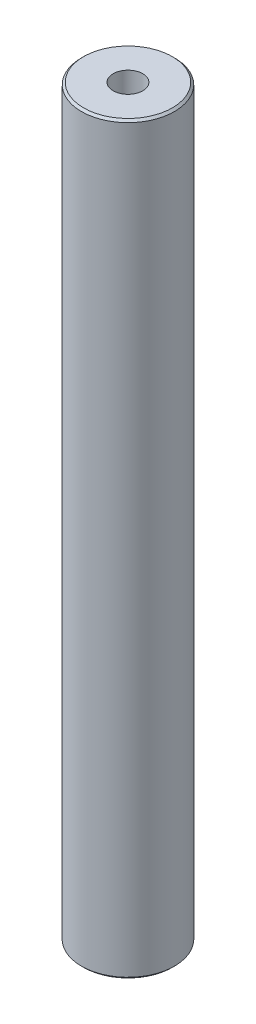
ISO-10303-21;
HEADER;
FILE_DESCRIPTION(('STEP AP214'),'2;1');
FILE_NAME('part.step','',(''),(''),'','','');
FILE_SCHEMA(('AUTOMOTIVE_DESIGN { 1 0 10303 214 1 1 1 1 }'));
ENDSEC;
DATA;
#1=APPLICATION_CONTEXT('core data for automotive mechanical design processes');
#2=APPLICATION_PROTOCOL_DEFINITION('international standard','automotive_design',2000,#1);
#3=PRODUCT_CONTEXT('',#1,'mechanical');
#4=PRODUCT('Part','Part','',(#3));
#5=PRODUCT_RELATED_PRODUCT_CATEGORY('part','',(#4));
#6=PRODUCT_DEFINITION_FORMATION('','',#4);
#7=PRODUCT_DEFINITION_CONTEXT('part definition',#1,'design');
#8=PRODUCT_DEFINITION('design','',#6,#7);
#9=PRODUCT_DEFINITION_SHAPE('','',#8);
#10=(LENGTH_UNIT() NAMED_UNIT(*) SI_UNIT(.MILLI.,.METRE.));
#11=(NAMED_UNIT(*) PLANE_ANGLE_UNIT() SI_UNIT($,.RADIAN.));
#12=(NAMED_UNIT(*) SI_UNIT($,.STERADIAN.) SOLID_ANGLE_UNIT());
#13=UNCERTAINTY_MEASURE_WITH_UNIT(LENGTH_MEASURE(1.E-05),#10,'distance_accuracy_value','');
#14=(GEOMETRIC_REPRESENTATION_CONTEXT(3) GLOBAL_UNCERTAINTY_ASSIGNED_CONTEXT((#13)) GLOBAL_UNIT_ASSIGNED_CONTEXT((#10,
#11,#12)) REPRESENTATION_CONTEXT('',''));
#15=CARTESIAN_POINT('',(0.,0.,0.));
#16=DIRECTION('',(0.,0.,1.));
#17=DIRECTION('',(1.,0.,0.));
#18=AXIS2_PLACEMENT_3D('',#15,#16,#17);
#19=CARTESIAN_POINT('',(0.,600.,0.));
#20=DIRECTION('',(0.,-1.,0.));
#21=DIRECTION('',(0.,0.,-1.));
#22=AXIS2_PLACEMENT_3D('',#19,#20,#21);
#23=CYLINDRICAL_SURFACE('',#22,37.5);
#24=CARTESIAN_POINT('',(0.,598.282689533271,0.));
#25=DIRECTION('',(0.,1.,0.));
#26=DIRECTION('',(0.,0.,1.));
#27=AXIS2_PLACEMENT_3D('',#24,#25,#26);
#28=CIRCLE('',#27,37.5);
#29=CARTESIAN_POINT('',(0.,598.282689533271,37.5));
#30=VERTEX_POINT('',#29);
#31=EDGE_CURVE('E50',#30,#30,#28,.F.);
#32=ORIENTED_EDGE('',*,*,#31,.T.);
#33=EDGE_LOOP('',(#32));
#34=FACE_BOUND('',#33,.T.);
#35=CARTESIAN_POINT('',(0.,1.71731046672852,0.));
#36=DIRECTION('',(0.,1.,0.));
#37=DIRECTION('',(0.,0.,1.));
#38=AXIS2_PLACEMENT_3D('',#35,#36,#37);
#39=CIRCLE('',#38,37.5);
#40=CARTESIAN_POINT('',(0.,1.71731046672852,37.5));
#41=VERTEX_POINT('',#40);
#42=EDGE_CURVE('E51',#41,#41,#39,.T.);
#43=ORIENTED_EDGE('',*,*,#42,.T.);
#44=EDGE_LOOP('',(#43));
#45=FACE_BOUND('',#44,.T.);
#46=ADVANCED_FACE('F39',(#34,#45),#23,.T.);
#47=CARTESIAN_POINT('',(0.,600.,0.));
#48=DIRECTION('',(0.,1.,0.));
#49=DIRECTION('',(0.,0.,1.));
#50=AXIS2_PLACEMENT_3D('',#47,#48,#49);
#51=PLANE('',#50);
#52=CARTESIAN_POINT('',(0.,600.,0.));
#53=DIRECTION('',(0.,1.,0.));
#54=DIRECTION('',(0.,0.,1.));
#55=AXIS2_PLACEMENT_3D('',#52,#53,#54);
#56=CIRCLE('',#55,35.7826895332714);
#57=CARTESIAN_POINT('',(0.,600.,35.7826895332714));
#58=VERTEX_POINT('',#57);
#59=EDGE_CURVE('E54',#58,#58,#56,.T.);
#60=ORIENTED_EDGE('',*,*,#59,.T.);
#61=EDGE_LOOP('',(#60));
#62=FACE_BOUND('',#61,.T.);
#63=CARTESIAN_POINT('',(0.,600.,0.));
#64=DIRECTION('',(0.,1.,0.));
#65=DIRECTION('',(0.,0.,1.));
#66=AXIS2_PLACEMENT_3D('',#63,#64,#65);
#67=CIRCLE('',#66,11.9451094618148);
#68=CARTESIAN_POINT('',(0.,600.,11.9451094618148));
#69=VERTEX_POINT('',#68);
#70=EDGE_CURVE('E58',#69,#69,#67,.T.);
#71=ORIENTED_EDGE('',*,*,#70,.F.);
#72=EDGE_LOOP('',(#71));
#73=FACE_BOUND('',#72,.T.);
#74=ADVANCED_FACE('F69',(#62,#73),#51,.T.);
#75=CARTESIAN_POINT('',(0.,0.,0.));
#76=DIRECTION('',(0.,1.,0.));
#77=DIRECTION('',(0.,0.,1.));
#78=AXIS2_PLACEMENT_3D('',#75,#76,#77);
#79=PLANE('',#78);
#80=CARTESIAN_POINT('',(0.,0.,0.));
#81=DIRECTION('',(0.,1.,0.));
#82=DIRECTION('',(0.,0.,1.));
#83=AXIS2_PLACEMENT_3D('',#80,#81,#82);
#84=CIRCLE('',#83,35.7826895332715);
#85=CARTESIAN_POINT('',(0.,0.,35.7826895332715));
#86=VERTEX_POINT('',#85);
#87=EDGE_CURVE('E10',#86,#86,#84,.F.);
#88=ORIENTED_EDGE('',*,*,#87,.T.);
#89=EDGE_LOOP('',(#88));
#90=FACE_BOUND('',#89,.T.);
#91=CARTESIAN_POINT('',(0.,0.,0.));
#92=DIRECTION('',(0.,1.,0.));
#93=DIRECTION('',(0.,0.,1.));
#94=AXIS2_PLACEMENT_3D('',#91,#92,#93);
#95=CIRCLE('',#94,11.9451094618148);
#96=CARTESIAN_POINT('',(0.,0.,11.9451094618148));
#97=VERTEX_POINT('',#96);
#98=EDGE_CURVE('E63',#97,#97,#95,.T.);
#99=ORIENTED_EDGE('',*,*,#98,.T.);
#100=EDGE_LOOP('',(#99));
#101=FACE_BOUND('',#100,.T.);
#102=ADVANCED_FACE('F75',(#90,#101),#79,.F.);
#103=CARTESIAN_POINT('',(0.,600.,0.));
#104=DIRECTION('',(0.,-1.,0.));
#105=DIRECTION('',(0.,0.,-1.));
#106=AXIS2_PLACEMENT_3D('',#103,#104,#105);
#107=CYLINDRICAL_SURFACE('',#106,11.9451094618148);
#108=ORIENTED_EDGE('',*,*,#70,.T.);
#109=EDGE_LOOP('',(#108));
#110=FACE_BOUND('',#109,.T.);
#111=ORIENTED_EDGE('',*,*,#98,.F.);
#112=EDGE_LOOP('',(#111));
#113=FACE_BOUND('',#112,.T.);
#114=ADVANCED_FACE('F70',(#110,#113),#107,.F.);
#115=CARTESIAN_POINT('',(0.,600.,0.));
#116=DIRECTION('',(0.,-1.,0.));
#117=DIRECTION('',(0.,0.,-1.));
#118=AXIS2_PLACEMENT_3D('',#115,#116,#117);
#119=CONICAL_SURFACE('',#118,35.7826895332714,0.785398163397408);
#120=ORIENTED_EDGE('',*,*,#31,.F.);
#121=EDGE_LOOP('',(#120));
#122=FACE_BOUND('',#121,.T.);
#123=ORIENTED_EDGE('',*,*,#59,.F.);
#124=EDGE_LOOP('',(#123));
#125=FACE_BOUND('',#124,.T.);
#126=ADVANCED_FACE('F81',(#122,#125),#119,.T.);
#127=CARTESIAN_POINT('',(0.,1.71731046672852,0.));
#128=DIRECTION('',(0.,1.,0.));
#129=DIRECTION('',(0.,0.,1.));
#130=AXIS2_PLACEMENT_3D('',#127,#128,#129);
#131=CONICAL_SURFACE('',#130,37.5,0.785398163397456);
#132=CARTESIAN_POINT('',(0.,0.,35.7826895332715));
#133=CARTESIAN_POINT('',(0.,0.0178886506950884,35.8005781839666));
#134=CARTESIAN_POINT('',(0.,0.0357773013901772,35.8184668346616));
#135=CARTESIAN_POINT('',(0.,0.0715546027803547,35.8542441360518));
#136=CARTESIAN_POINT('',(0.,0.0894432534754434,35.8721327867469));
#137=CARTESIAN_POINT('',(0.,0.125220554865621,35.9079100881371));
#138=CARTESIAN_POINT('',(0.,0.143109205560709,35.9257987388322));
#139=CARTESIAN_POINT('',(0.,0.178886506950887,35.9615760402223));
#140=CARTESIAN_POINT('',(0.,0.196775157645976,35.9794646909174));
#141=CARTESIAN_POINT('',(0.,0.232552459036154,36.0152419923076));
#142=CARTESIAN_POINT('',(0.,0.250441109731241,36.0331306430027));
#143=CARTESIAN_POINT('',(0.,0.286218411121418,36.0689079443929));
#144=CARTESIAN_POINT('',(0.,0.304107061816508,36.086796595088));
#145=CARTESIAN_POINT('',(0.,0.339884363206686,36.1225738964782));
#146=CARTESIAN_POINT('',(0.,0.357773013901774,36.1404625471732));
#147=CARTESIAN_POINT('',(0.,0.393550315291951,36.1762398485634));
#148=CARTESIAN_POINT('',(0.,0.41143896598704,36.1941284992585));
#149=CARTESIAN_POINT('',(0.,0.447216267377218,36.2299058006487));
#150=CARTESIAN_POINT('',(0.,0.465104918072306,36.2477944513438));
#151=CARTESIAN_POINT('',(0.,0.500882219462484,36.283571752734));
#152=CARTESIAN_POINT('',(0.,0.518770870157573,36.301460403429));
#153=CARTESIAN_POINT('',(0.,0.55454817154775,36.3372377048192));
#154=CARTESIAN_POINT('',(0.,0.572436822242838,36.3551263555143));
#155=CARTESIAN_POINT('',(0.,0.608214123633016,36.3909036569045));
#156=CARTESIAN_POINT('',(0.,0.626102774328106,36.4087923075996));
#157=CARTESIAN_POINT('',(0.,0.661880075718283,36.4445696089898));
#158=CARTESIAN_POINT('',(0.,0.679768726413371,36.4624582596848));
#159=CARTESIAN_POINT('',(0.,0.715546027803548,36.498235561075));
#160=CARTESIAN_POINT('',(0.,0.733434678498637,36.5161242117701));
#161=CARTESIAN_POINT('',(0.,0.769211979888815,36.5519015131603));
#162=CARTESIAN_POINT('',(0.,0.787100630583903,36.5697901638554));
#163=CARTESIAN_POINT('',(0.,0.822877931974081,36.6055674652456));
#164=CARTESIAN_POINT('',(0.,0.840766582669169,36.6234561159406));
#165=CARTESIAN_POINT('',(0.,0.876543884059347,36.6592334173308));
#166=CARTESIAN_POINT('',(0.,0.894432534754436,36.6771220680259));
#167=CARTESIAN_POINT('',(0.,0.930209836144613,36.7128993694161));
#168=CARTESIAN_POINT('',(0.,0.948098486839702,36.7307880201112));
#169=CARTESIAN_POINT('',(0.,0.983875788229879,36.7665653215014));
#170=CARTESIAN_POINT('',(0.,1.00176443892497,36.7844539721964));
#171=CARTESIAN_POINT('',(0.,1.03754174031515,36.8202312735866));
#172=CARTESIAN_POINT('',(0.,1.05543039101023,36.8381199242817));
#173=CARTESIAN_POINT('',(0.,1.09120769240041,36.8738972256719));
#174=CARTESIAN_POINT('',(0.,1.1090963430955,36.891785876367));
#175=CARTESIAN_POINT('',(0.,1.14487364448568,36.9275631777572));
#176=CARTESIAN_POINT('',(0.,1.16276229518077,36.9454518284522));
#177=CARTESIAN_POINT('',(0.,1.19853959657094,36.9812291298424));
#178=CARTESIAN_POINT('',(0.,1.21642824726603,36.9991177805375));
#179=CARTESIAN_POINT('',(0.,1.25220554865621,37.0348950819277));
#180=CARTESIAN_POINT('',(0.,1.2700941993513,37.0527837326228));
#181=CARTESIAN_POINT('',(0.,1.30587150074148,37.088561034013));
#182=CARTESIAN_POINT('',(0.,1.32376015143656,37.106449684708));
#183=CARTESIAN_POINT('',(0.,1.35953745282674,37.1422269860982));
#184=CARTESIAN_POINT('',(0.,1.37742610352183,37.1601156367933));
#185=CARTESIAN_POINT('',(0.,1.41320340491201,37.1958929381835));
#186=CARTESIAN_POINT('',(0.,1.4310920556071,37.2137815888786));
#187=CARTESIAN_POINT('',(0.,1.46686935699728,37.2495588902688));
#188=CARTESIAN_POINT('',(0.,1.48475800769236,37.2674475409639));
#189=CARTESIAN_POINT('',(0.,1.52053530908254,37.303224842354));
#190=CARTESIAN_POINT('',(0.,1.53842395977763,37.3211134930491));
#191=CARTESIAN_POINT('',(0.,1.57420126116781,37.3568907944393));
#192=CARTESIAN_POINT('',(0.,1.5920899118629,37.3747794451344));
#193=CARTESIAN_POINT('',(0.,1.62786721325307,37.4105567465246));
#194=CARTESIAN_POINT('',(0.,1.64575586394816,37.4284453972196));
#195=CARTESIAN_POINT('',(0.,1.68153316533834,37.4642226986098));
#196=CARTESIAN_POINT('',(0.,1.69942181603343,37.4821113493049));
#197=CARTESIAN_POINT('',(0.,1.71731046672852,37.5));
#198=B_SPLINE_CURVE_WITH_KNOTS('',3,(#132,#133,#134,#135,#136,#137,#138,#139,#140,#141,#142,
#143,#144,#145,#146,#147,#148,#149,#150,#151,#152,#153,#154,#155,#156,#157,#158,#159,#160,#161,
#162,#163,#164,#165,#166,#167,#168,#169,#170,#171,#172,#173,#174,#175,#176,#177,#178,#179,#180,
#181,#182,#183,#184,#185,#186,#187,#188,#189,#190,#191,#192,#193,#194,#195,#196,#197),
.UNSPECIFIED.,.F.,.F.,(4,2,2,2,2,2,2,2,2,2,2,2,2,2,2,2,2,2,2,2,2,2,2,2,2,2,2,2,2,2,2,2,4),(0.,
0.0758951172766481,0.151790234553296,0.227685351829944,0.303580469106592,0.379475586383245,
0.455370703659893,0.531265820936541,0.60716093821319,0.683056055489838,0.758951172766486,
0.834846290043134,0.910741407319782,0.986636524596435,1.06253164187308,1.13842675914973,
1.21432187642638,1.29021699370303,1.36611211097968,1.44200722825632,1.51790234553297,
1.59379746280962,1.66969258008627,1.74558769736292,1.82148281463957,1.89737793191622,
1.97327304919286,2.04916816646951,2.12506328374617,2.20095840102281,2.27685351829946,
2.35274863557611,2.42864375285276),.UNSPECIFIED.);
#199=EDGE_CURVE('BSEAM45',#86,#41,#198,.T.);
#200=ORIENTED_EDGE('',*,*,#87,.F.);
#201=ORIENTED_EDGE('',*,*,#42,.F.);
#202=ORIENTED_EDGE('',*,*,#199,.T.);
#203=ORIENTED_EDGE('',*,*,#199,.F.);
#204=EDGE_LOOP('',(#200,#202,#201,#203));
#205=FACE_BOUND('',#204,.T.);
#206=ADVANCED_FACE('F45',(#205),#131,.T.);
#207=CLOSED_SHELL('',(#46,#74,#102,#114,#126,#206));
#208=MANIFOLD_SOLID_BREP('B2',#207);
#209=ADVANCED_BREP_SHAPE_REPRESENTATION('',(#18,#208),#14);
#210=SHAPE_DEFINITION_REPRESENTATION(#9,#209);
ENDSEC;
END-ISO-10303-21;
